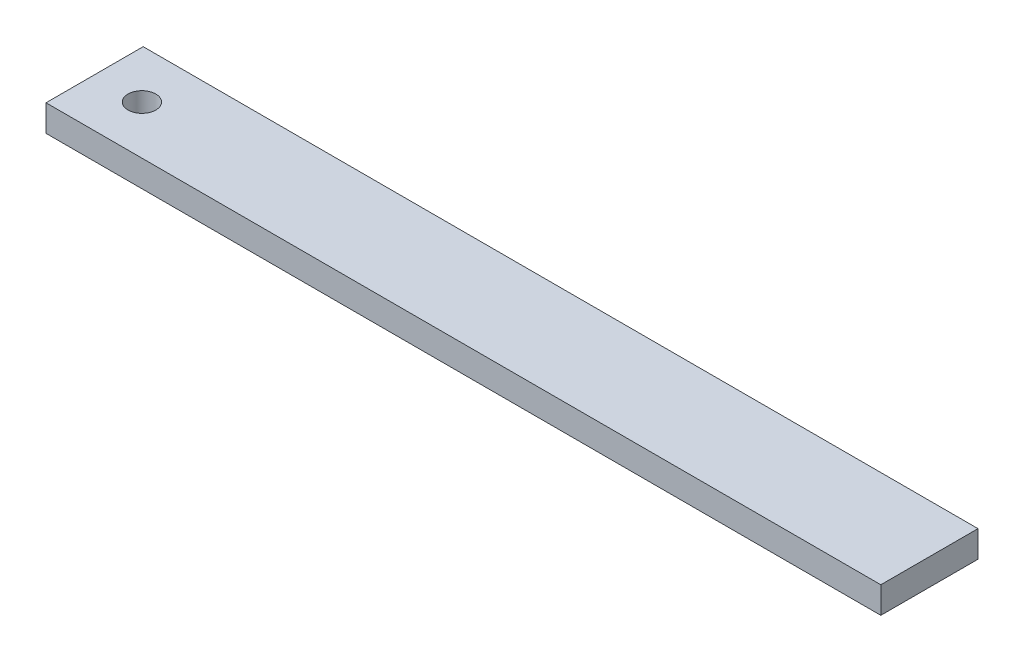
ISO-10303-21;
HEADER;
FILE_DESCRIPTION(('STEP AP214'),'2;1');
FILE_NAME('part.step','',(''),(''),'','','');
FILE_SCHEMA(('AUTOMOTIVE_DESIGN { 1 0 10303 214 1 1 1 1 }'));
ENDSEC;
DATA;
#1=APPLICATION_CONTEXT('core data for automotive mechanical design processes');
#2=APPLICATION_PROTOCOL_DEFINITION('international standard','automotive_design',2000,#1);
#3=PRODUCT_CONTEXT('',#1,'mechanical');
#4=PRODUCT('Part','Part','',(#3));
#5=PRODUCT_RELATED_PRODUCT_CATEGORY('part','',(#4));
#6=PRODUCT_DEFINITION_FORMATION('','',#4);
#7=PRODUCT_DEFINITION_CONTEXT('part definition',#1,'design');
#8=PRODUCT_DEFINITION('design','',#6,#7);
#9=PRODUCT_DEFINITION_SHAPE('','',#8);
#10=(LENGTH_UNIT() NAMED_UNIT(*) SI_UNIT(.MILLI.,.METRE.));
#11=(NAMED_UNIT(*) PLANE_ANGLE_UNIT() SI_UNIT($,.RADIAN.));
#12=(NAMED_UNIT(*) SI_UNIT($,.STERADIAN.) SOLID_ANGLE_UNIT());
#13=UNCERTAINTY_MEASURE_WITH_UNIT(LENGTH_MEASURE(1.E-05),#10,'distance_accuracy_value','');
#14=(GEOMETRIC_REPRESENTATION_CONTEXT(3) GLOBAL_UNCERTAINTY_ASSIGNED_CONTEXT((#13)) GLOBAL_UNIT_ASSIGNED_CONTEXT((#10,
#11,#12)) REPRESENTATION_CONTEXT('',''));
#15=CARTESIAN_POINT('',(0.,0.,0.));
#16=DIRECTION('',(0.,0.,1.));
#17=DIRECTION('',(1.,0.,0.));
#18=AXIS2_PLACEMENT_3D('',#15,#16,#17);
#19=CARTESIAN_POINT('',(0.,9.525,0.));
#20=DIRECTION('',(0.,1.,0.));
#21=DIRECTION('',(0.,0.,1.));
#22=AXIS2_PLACEMENT_3D('',#19,#20,#21);
#23=PLANE('',#22);
#24=DIRECTION('',(0.,0.,-1.));
#25=VECTOR('',#24,1.);
#26=CARTESIAN_POINT('',(0.,9.525,0.));
#27=LINE('',#26,#25);
#28=CARTESIAN_POINT('',(0.,9.525,0.));
#29=VERTEX_POINT('',#28);
#30=CARTESIAN_POINT('',(0.,9.525,-34.925));
#31=VERTEX_POINT('',#30);
#32=EDGE_CURVE('E85',#29,#31,#27,.T.);
#33=ORIENTED_EDGE('',*,*,#32,.T.);
#34=DIRECTION('',(-1.,0.,0.));
#35=VECTOR('',#34,1.);
#36=CARTESIAN_POINT('',(0.,9.525,-34.925));
#37=LINE('',#36,#35);
#38=CARTESIAN_POINT('',(-300.,9.525,-34.925));
#39=VERTEX_POINT('',#38);
#40=EDGE_CURVE('E80',#31,#39,#37,.T.);
#41=ORIENTED_EDGE('',*,*,#40,.T.);
#42=DIRECTION('',(0.,0.,1.));
#43=VECTOR('',#42,1.);
#44=CARTESIAN_POINT('',(-300.,9.525,0.));
#45=LINE('',#44,#43);
#46=CARTESIAN_POINT('',(-300.,9.525,0.));
#47=VERTEX_POINT('',#46);
#48=EDGE_CURVE('E83',#39,#47,#45,.T.);
#49=ORIENTED_EDGE('',*,*,#48,.T.);
#50=DIRECTION('',(1.,0.,0.));
#51=VECTOR('',#50,1.);
#52=CARTESIAN_POINT('',(0.,9.525,0.));
#53=LINE('',#52,#51);
#54=EDGE_CURVE('E50',#47,#29,#53,.T.);
#55=ORIENTED_EDGE('',*,*,#54,.T.);
#56=EDGE_LOOP('',(#33,#41,#49,#55));
#57=FACE_BOUND('',#56,.T.);
#58=CARTESIAN_POINT('',(-283.,9.525,-17.4625));
#59=DIRECTION('',(0.,1.,0.));
#60=DIRECTION('',(0.,0.,1.));
#61=AXIS2_PLACEMENT_3D('',#58,#59,#60);
#62=CIRCLE('',#61,4.99999999999999);
#63=CARTESIAN_POINT('',(-283.,9.525,-12.4625));
#64=VERTEX_POINT('',#63);
#65=EDGE_CURVE('E100',#64,#64,#62,.T.);
#66=ORIENTED_EDGE('',*,*,#65,.F.);
#67=EDGE_LOOP('',(#66));
#68=FACE_BOUND('',#67,.T.);
#69=ADVANCED_FACE('F33',(#57,#68),#23,.T.);
#70=CARTESIAN_POINT('',(0.,0.,0.));
#71=DIRECTION('',(0.,1.,0.));
#72=DIRECTION('',(0.,0.,1.));
#73=AXIS2_PLACEMENT_3D('',#70,#71,#72);
#74=PLANE('',#73);
#75=DIRECTION('',(0.,0.,-1.));
#76=VECTOR('',#75,1.);
#77=CARTESIAN_POINT('',(0.,0.,0.));
#78=LINE('',#77,#76);
#79=CARTESIAN_POINT('',(0.,0.,0.));
#80=VERTEX_POINT('',#79);
#81=CARTESIAN_POINT('',(0.,0.,-34.925));
#82=VERTEX_POINT('',#81);
#83=EDGE_CURVE('E97',#80,#82,#78,.T.);
#84=ORIENTED_EDGE('',*,*,#83,.F.);
#85=DIRECTION('',(1.,0.,0.));
#86=VECTOR('',#85,1.);
#87=CARTESIAN_POINT('',(0.,0.,0.));
#88=LINE('',#87,#86);
#89=CARTESIAN_POINT('',(-300.,0.,0.));
#90=VERTEX_POINT('',#89);
#91=EDGE_CURVE('E73',#90,#80,#88,.T.);
#92=ORIENTED_EDGE('',*,*,#91,.F.);
#93=DIRECTION('',(0.,0.,1.));
#94=VECTOR('',#93,1.);
#95=CARTESIAN_POINT('',(-300.,0.,0.));
#96=LINE('',#95,#94);
#97=CARTESIAN_POINT('',(-300.,0.,-34.925));
#98=VERTEX_POINT('',#97);
#99=EDGE_CURVE('E67',#98,#90,#96,.T.);
#100=ORIENTED_EDGE('',*,*,#99,.F.);
#101=DIRECTION('',(-1.,0.,0.));
#102=VECTOR('',#101,1.);
#103=CARTESIAN_POINT('',(0.,0.,-34.925));
#104=LINE('',#103,#102);
#105=EDGE_CURVE('E89',#82,#98,#104,.T.);
#106=ORIENTED_EDGE('',*,*,#105,.F.);
#107=EDGE_LOOP('',(#84,#92,#100,#106));
#108=FACE_BOUND('',#107,.T.);
#109=CARTESIAN_POINT('',(-283.,0.,-17.4625));
#110=DIRECTION('',(0.,1.,0.));
#111=DIRECTION('',(0.,0.,1.));
#112=AXIS2_PLACEMENT_3D('',#109,#110,#111);
#113=CIRCLE('',#112,4.99999999999999);
#114=CARTESIAN_POINT('',(-283.,0.,-12.4625));
#115=VERTEX_POINT('',#114);
#116=EDGE_CURVE('E112',#115,#115,#113,.T.);
#117=ORIENTED_EDGE('',*,*,#116,.T.);
#118=EDGE_LOOP('',(#117));
#119=FACE_BOUND('',#118,.T.);
#120=ADVANCED_FACE('F108',(#108,#119),#74,.F.);
#121=CARTESIAN_POINT('',(0.,9.525,0.));
#122=DIRECTION('',(-1.,0.,0.));
#123=DIRECTION('',(0.,0.,1.));
#124=AXIS2_PLACEMENT_3D('',#121,#122,#123);
#125=PLANE('',#124);
#126=ORIENTED_EDGE('',*,*,#83,.T.);
#127=DIRECTION('',(0.,-1.,0.));
#128=VECTOR('',#127,1.);
#129=CARTESIAN_POINT('',(0.,9.525,-34.925));
#130=LINE('',#129,#128);
#131=EDGE_CURVE('E11',#31,#82,#130,.T.);
#132=ORIENTED_EDGE('',*,*,#131,.F.);
#133=ORIENTED_EDGE('',*,*,#32,.F.);
#134=DIRECTION('',(0.,-1.,0.));
#135=VECTOR('',#134,1.);
#136=CARTESIAN_POINT('',(0.,9.525,0.));
#137=LINE('',#136,#135);
#138=EDGE_CURVE('E93',#29,#80,#137,.T.);
#139=ORIENTED_EDGE('',*,*,#138,.T.);
#140=EDGE_LOOP('',(#126,#132,#133,#139));
#141=FACE_BOUND('',#140,.T.);
#142=ADVANCED_FACE('F35',(#141),#125,.F.);
#143=CARTESIAN_POINT('',(0.,9.525,-34.925));
#144=DIRECTION('',(0.,0.,1.));
#145=DIRECTION('',(1.,0.,0.));
#146=AXIS2_PLACEMENT_3D('',#143,#144,#145);
#147=PLANE('',#146);
#148=ORIENTED_EDGE('',*,*,#105,.T.);
#149=DIRECTION('',(0.,-1.,0.));
#150=VECTOR('',#149,1.);
#151=CARTESIAN_POINT('',(-300.,9.525,-34.925));
#152=LINE('',#151,#150);
#153=EDGE_CURVE('E42',#39,#98,#152,.T.);
#154=ORIENTED_EDGE('',*,*,#153,.F.);
#155=ORIENTED_EDGE('',*,*,#40,.F.);
#156=ORIENTED_EDGE('',*,*,#131,.T.);
#157=EDGE_LOOP('',(#148,#154,#155,#156));
#158=FACE_BOUND('',#157,.T.);
#159=ADVANCED_FACE('F88',(#158),#147,.F.);
#160=CARTESIAN_POINT('',(-300.,9.525,0.));
#161=DIRECTION('',(1.,0.,0.));
#162=DIRECTION('',(0.,0.,-1.));
#163=AXIS2_PLACEMENT_3D('',#160,#161,#162);
#164=PLANE('',#163);
#165=ORIENTED_EDGE('',*,*,#99,.T.);
#166=DIRECTION('',(0.,-1.,0.));
#167=VECTOR('',#166,1.);
#168=CARTESIAN_POINT('',(-300.,9.525,0.));
#169=LINE('',#168,#167);
#170=EDGE_CURVE('E90',#47,#90,#169,.T.);
#171=ORIENTED_EDGE('',*,*,#170,.F.);
#172=ORIENTED_EDGE('',*,*,#48,.F.);
#173=ORIENTED_EDGE('',*,*,#153,.T.);
#174=EDGE_LOOP('',(#165,#171,#172,#173));
#175=FACE_BOUND('',#174,.T.);
#176=ADVANCED_FACE('F91',(#175),#164,.F.);
#177=CARTESIAN_POINT('',(0.,9.525,0.));
#178=DIRECTION('',(0.,0.,-1.));
#179=DIRECTION('',(-1.,0.,0.));
#180=AXIS2_PLACEMENT_3D('',#177,#178,#179);
#181=PLANE('',#180);
#182=ORIENTED_EDGE('',*,*,#91,.T.);
#183=ORIENTED_EDGE('',*,*,#138,.F.);
#184=ORIENTED_EDGE('',*,*,#54,.F.);
#185=ORIENTED_EDGE('',*,*,#170,.T.);
#186=EDGE_LOOP('',(#182,#183,#184,#185));
#187=FACE_BOUND('',#186,.T.);
#188=ADVANCED_FACE('F105',(#187),#181,.F.);
#189=CARTESIAN_POINT('',(-283.,9.525,-17.4625));
#190=DIRECTION('',(0.,-1.,0.));
#191=DIRECTION('',(0.,0.,-1.));
#192=AXIS2_PLACEMENT_3D('',#189,#190,#191);
#193=CYLINDRICAL_SURFACE('',#192,4.99999999999999);
#194=ORIENTED_EDGE('',*,*,#65,.T.);
#195=EDGE_LOOP('',(#194));
#196=FACE_BOUND('',#195,.T.);
#197=ORIENTED_EDGE('',*,*,#116,.F.);
#198=EDGE_LOOP('',(#197));
#199=FACE_BOUND('',#198,.T.);
#200=ADVANCED_FACE('F118',(#196,#199),#193,.F.);
#201=CLOSED_SHELL('',(#69,#120,#142,#159,#176,#188,#200));
#202=MANIFOLD_SOLID_BREP('B2',#201);
#203=ADVANCED_BREP_SHAPE_REPRESENTATION('',(#18,#202),#14);
#204=SHAPE_DEFINITION_REPRESENTATION(#9,#203);
ENDSEC;
END-ISO-10303-21;
